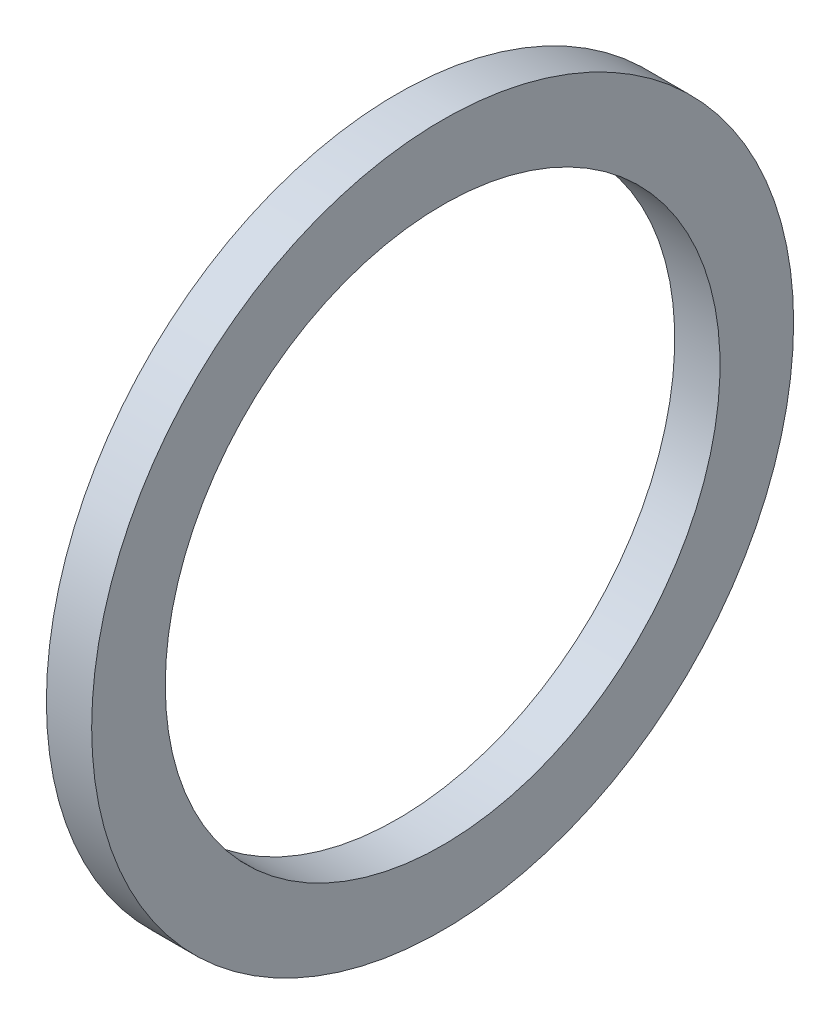
ISO-10303-21;
HEADER;
FILE_DESCRIPTION(('STEP AP214'),'2;1');
FILE_NAME('part.step','',(''),(''),'','','');
FILE_SCHEMA(('AUTOMOTIVE_DESIGN { 1 0 10303 214 1 1 1 1 }'));
ENDSEC;
DATA;
#1=APPLICATION_CONTEXT('core data for automotive mechanical design processes');
#2=APPLICATION_PROTOCOL_DEFINITION('international standard','automotive_design',2000,#1);
#3=PRODUCT_CONTEXT('',#1,'mechanical');
#4=PRODUCT('Part','Part','',(#3));
#5=PRODUCT_RELATED_PRODUCT_CATEGORY('part','',(#4));
#6=PRODUCT_DEFINITION_FORMATION('','',#4);
#7=PRODUCT_DEFINITION_CONTEXT('part definition',#1,'design');
#8=PRODUCT_DEFINITION('design','',#6,#7);
#9=PRODUCT_DEFINITION_SHAPE('','',#8);
#10=(LENGTH_UNIT() NAMED_UNIT(*) SI_UNIT(.MILLI.,.METRE.));
#11=(NAMED_UNIT(*) PLANE_ANGLE_UNIT() SI_UNIT($,.RADIAN.));
#12=(NAMED_UNIT(*) SI_UNIT($,.STERADIAN.) SOLID_ANGLE_UNIT());
#13=UNCERTAINTY_MEASURE_WITH_UNIT(LENGTH_MEASURE(1.E-05),#10,'distance_accuracy_value','');
#14=(GEOMETRIC_REPRESENTATION_CONTEXT(3) GLOBAL_UNCERTAINTY_ASSIGNED_CONTEXT((#13)) GLOBAL_UNIT_ASSIGNED_CONTEXT((#10,
#11,#12)) REPRESENTATION_CONTEXT('',''));
#15=CARTESIAN_POINT('',(0.,0.,0.));
#16=DIRECTION('',(0.,0.,1.));
#17=DIRECTION('',(1.,0.,0.));
#18=AXIS2_PLACEMENT_3D('',#15,#16,#17);
#19=CARTESIAN_POINT('',(0.,-12.446,0.));
#20=DIRECTION('',(-1.,0.,0.));
#21=DIRECTION('',(0.,0.,1.));
#22=AXIS2_PLACEMENT_3D('',#19,#20,#21);
#23=PLANE('',#22);
#24=CARTESIAN_POINT('',(0.,0.,0.));
#25=DIRECTION('',(-1.,0.,0.));
#26=DIRECTION('',(0.,0.,1.));
#27=AXIS2_PLACEMENT_3D('',#24,#25,#26);
#28=CIRCLE('',#27,15.748);
#29=CARTESIAN_POINT('',(0.,0.,15.748));
#30=VERTEX_POINT('',#29);
#31=EDGE_CURVE('E10',#30,#30,#28,.T.);
#32=ORIENTED_EDGE('',*,*,#31,.T.);
#33=EDGE_LOOP('',(#32));
#34=FACE_BOUND('',#33,.T.);
#35=CARTESIAN_POINT('',(0.,0.,0.));
#36=DIRECTION('',(-1.,0.,0.));
#37=DIRECTION('',(0.,0.,1.));
#38=AXIS2_PLACEMENT_3D('',#35,#36,#37);
#39=CIRCLE('',#38,12.446);
#40=CARTESIAN_POINT('',(0.,0.,12.446));
#41=VERTEX_POINT('',#40);
#42=EDGE_CURVE('E43',#41,#41,#39,.T.);
#43=ORIENTED_EDGE('',*,*,#42,.F.);
#44=EDGE_LOOP('',(#43));
#45=FACE_BOUND('',#44,.T.);
#46=ADVANCED_FACE('F29',(#34,#45),#23,.T.);
#47=CARTESIAN_POINT('',(-43.7165807560137,0.,0.));
#48=DIRECTION('',(-1.,0.,0.));
#49=DIRECTION('',(0.,0.,1.));
#50=AXIS2_PLACEMENT_3D('',#47,#48,#49);
#51=CYLINDRICAL_SURFACE('',#50,15.748);
#52=CARTESIAN_POINT('',(2.032,0.,0.));
#53=DIRECTION('',(-1.,0.,0.));
#54=DIRECTION('',(0.,0.,1.));
#55=AXIS2_PLACEMENT_3D('',#52,#53,#54);
#56=CIRCLE('',#55,15.748);
#57=CARTESIAN_POINT('',(2.032,0.,15.748));
#58=VERTEX_POINT('',#57);
#59=EDGE_CURVE('E35',#58,#58,#56,.T.);
#60=ORIENTED_EDGE('',*,*,#59,.T.);
#61=EDGE_LOOP('',(#60));
#62=FACE_BOUND('',#61,.T.);
#63=ORIENTED_EDGE('',*,*,#31,.F.);
#64=EDGE_LOOP('',(#63));
#65=FACE_BOUND('',#64,.T.);
#66=ADVANCED_FACE('F53',(#62,#65),#51,.T.);
#67=CARTESIAN_POINT('',(2.032,-12.446,0.));
#68=DIRECTION('',(1.,0.,0.));
#69=DIRECTION('',(0.,0.,-1.));
#70=AXIS2_PLACEMENT_3D('',#67,#68,#69);
#71=PLANE('',#70);
#72=CARTESIAN_POINT('',(2.032,0.,0.));
#73=DIRECTION('',(-1.,0.,0.));
#74=DIRECTION('',(0.,0.,1.));
#75=AXIS2_PLACEMENT_3D('',#72,#73,#74);
#76=CIRCLE('',#75,12.446);
#77=CARTESIAN_POINT('',(2.032,0.,12.446));
#78=VERTEX_POINT('',#77);
#79=EDGE_CURVE('E39',#78,#78,#76,.T.);
#80=ORIENTED_EDGE('',*,*,#79,.T.);
#81=EDGE_LOOP('',(#80));
#82=FACE_BOUND('',#81,.T.);
#83=ORIENTED_EDGE('',*,*,#59,.F.);
#84=EDGE_LOOP('',(#83));
#85=FACE_BOUND('',#84,.T.);
#86=ADVANCED_FACE('F57',(#82,#85),#71,.T.);
#87=CARTESIAN_POINT('',(-43.7165807560137,0.,0.));
#88=DIRECTION('',(-1.,0.,0.));
#89=DIRECTION('',(0.,0.,1.));
#90=AXIS2_PLACEMENT_3D('',#87,#88,#89);
#91=CYLINDRICAL_SURFACE('',#90,12.446);
#92=ORIENTED_EDGE('',*,*,#42,.T.);
#93=EDGE_LOOP('',(#92));
#94=FACE_BOUND('',#93,.T.);
#95=ORIENTED_EDGE('',*,*,#79,.F.);
#96=EDGE_LOOP('',(#95));
#97=FACE_BOUND('',#96,.T.);
#98=ADVANCED_FACE('F49',(#94,#97),#91,.F.);
#99=CLOSED_SHELL('',(#46,#66,#86,#98));
#100=MANIFOLD_SOLID_BREP('B2',#99);
#101=ADVANCED_BREP_SHAPE_REPRESENTATION('',(#18,#100),#14);
#102=SHAPE_DEFINITION_REPRESENTATION(#9,#101);
ENDSEC;
END-ISO-10303-21;
